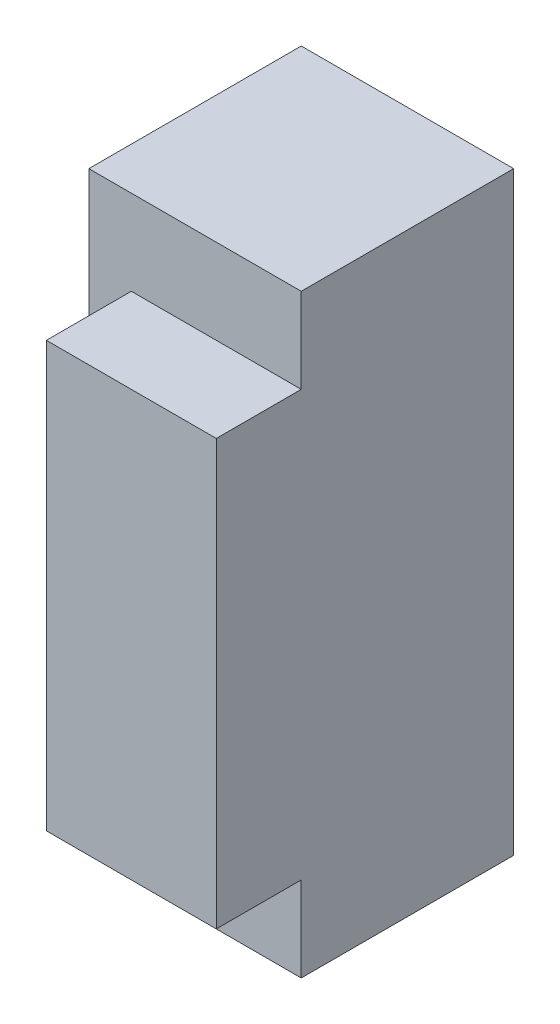
ISO-10303-21;
HEADER;
FILE_DESCRIPTION(('STEP AP214'),'2;1');
FILE_NAME('part.step','',(''),(''),'','','');
FILE_SCHEMA(('AUTOMOTIVE_DESIGN { 1 0 10303 214 1 1 1 1 }'));
ENDSEC;
DATA;
#1=APPLICATION_CONTEXT('core data for automotive mechanical design processes');
#2=APPLICATION_PROTOCOL_DEFINITION('international standard','automotive_design',2000,#1);
#3=PRODUCT_CONTEXT('',#1,'mechanical');
#4=PRODUCT('Part','Part','',(#3));
#5=PRODUCT_RELATED_PRODUCT_CATEGORY('part','',(#4));
#6=PRODUCT_DEFINITION_FORMATION('','',#4);
#7=PRODUCT_DEFINITION_CONTEXT('part definition',#1,'design');
#8=PRODUCT_DEFINITION('design','',#6,#7);
#9=PRODUCT_DEFINITION_SHAPE('','',#8);
#10=(LENGTH_UNIT() NAMED_UNIT(*) SI_UNIT(.MILLI.,.METRE.));
#11=(NAMED_UNIT(*) PLANE_ANGLE_UNIT() SI_UNIT($,.RADIAN.));
#12=(NAMED_UNIT(*) SI_UNIT($,.STERADIAN.) SOLID_ANGLE_UNIT());
#13=UNCERTAINTY_MEASURE_WITH_UNIT(LENGTH_MEASURE(1.E-05),#10,'distance_accuracy_value','');
#14=(GEOMETRIC_REPRESENTATION_CONTEXT(3) GLOBAL_UNCERTAINTY_ASSIGNED_CONTEXT((#13)) GLOBAL_UNIT_ASSIGNED_CONTEXT((#10,
#11,#12)) REPRESENTATION_CONTEXT('',''));
#15=CARTESIAN_POINT('',(0.,0.,0.));
#16=DIRECTION('',(0.,0.,1.));
#17=DIRECTION('',(1.,0.,0.));
#18=AXIS2_PLACEMENT_3D('',#15,#16,#17);
#19=CARTESIAN_POINT('',(-2.5,7.,5.));
#20=DIRECTION('',(1.,0.,0.));
#21=DIRECTION('',(0.,0.,-1.));
#22=AXIS2_PLACEMENT_3D('',#19,#20,#21);
#23=PLANE('',#22);
#24=DIRECTION('',(0.,-1.,0.));
#25=VECTOR('',#24,1.);
#26=CARTESIAN_POINT('',(-2.5,7.,0.));
#27=LINE('',#26,#25);
#28=CARTESIAN_POINT('',(-2.5,7.,0.));
#29=VERTEX_POINT('',#28);
#30=CARTESIAN_POINT('',(-2.5,-7.,0.));
#31=VERTEX_POINT('',#30);
#32=EDGE_CURVE('E118',#29,#31,#27,.T.);
#33=ORIENTED_EDGE('',*,*,#32,.T.);
#34=DIRECTION('',(0.,0.,-1.));
#35=VECTOR('',#34,1.);
#36=CARTESIAN_POINT('',(-2.5,-7.,5.));
#37=LINE('',#36,#35);
#38=CARTESIAN_POINT('',(-2.5,-7.,5.));
#39=VERTEX_POINT('',#38);
#40=EDGE_CURVE('E11',#39,#31,#37,.T.);
#41=ORIENTED_EDGE('',*,*,#40,.F.);
#42=DIRECTION('',(0.,-1.,0.));
#43=VECTOR('',#42,1.);
#44=CARTESIAN_POINT('',(-2.5,7.,5.));
#45=LINE('',#44,#43);
#46=CARTESIAN_POINT('',(-2.5,7.,5.));
#47=VERTEX_POINT('',#46);
#48=EDGE_CURVE('E140',#47,#39,#45,.T.);
#49=ORIENTED_EDGE('',*,*,#48,.F.);
#50=DIRECTION('',(0.,0.,-1.));
#51=VECTOR('',#50,1.);
#52=CARTESIAN_POINT('',(-2.5,7.,5.));
#53=LINE('',#52,#51);
#54=EDGE_CURVE('E159',#47,#29,#53,.T.);
#55=ORIENTED_EDGE('',*,*,#54,.T.);
#56=EDGE_LOOP('',(#33,#41,#49,#55));
#57=FACE_BOUND('',#56,.T.);
#58=ADVANCED_FACE('F30',(#57),#23,.F.);
#59=CARTESIAN_POINT('',(-2.5,-7.,5.));
#60=DIRECTION('',(0.,1.,0.));
#61=DIRECTION('',(0.,0.,1.));
#62=AXIS2_PLACEMENT_3D('',#59,#60,#61);
#63=PLANE('',#62);
#64=DIRECTION('',(1.,0.,0.));
#65=VECTOR('',#64,1.);
#66=CARTESIAN_POINT('',(-2.5,-7.,0.));
#67=LINE('',#66,#65);
#68=CARTESIAN_POINT('',(2.5,-7.,0.));
#69=VERTEX_POINT('',#68);
#70=EDGE_CURVE('E121',#31,#69,#67,.T.);
#71=ORIENTED_EDGE('',*,*,#70,.T.);
#72=DIRECTION('',(0.,0.,-1.));
#73=VECTOR('',#72,1.);
#74=CARTESIAN_POINT('',(2.5,-7.,5.));
#75=LINE('',#74,#73);
#76=CARTESIAN_POINT('',(2.5,-7.,5.));
#77=VERTEX_POINT('',#76);
#78=EDGE_CURVE('E38',#77,#69,#75,.T.);
#79=ORIENTED_EDGE('',*,*,#78,.F.);
#80=DIRECTION('',(1.,0.,0.));
#81=VECTOR('',#80,1.);
#82=CARTESIAN_POINT('',(-2.5,-7.,5.));
#83=LINE('',#82,#81);
#84=EDGE_CURVE('E143',#39,#77,#83,.T.);
#85=ORIENTED_EDGE('',*,*,#84,.F.);
#86=ORIENTED_EDGE('',*,*,#40,.T.);
#87=EDGE_LOOP('',(#71,#79,#85,#86));
#88=FACE_BOUND('',#87,.T.);
#89=ADVANCED_FACE('F167',(#88),#63,.F.);
#90=CARTESIAN_POINT('',(2.5,7.,5.));
#91=DIRECTION('',(-1.,0.,0.));
#92=DIRECTION('',(0.,-1.,0.));
#93=AXIS2_PLACEMENT_3D('',#90,#91,#92);
#94=PLANE('',#93);
#95=DIRECTION('',(0.,1.,0.));
#96=VECTOR('',#95,1.);
#97=CARTESIAN_POINT('',(2.5,7.,0.));
#98=LINE('',#97,#96);
#99=CARTESIAN_POINT('',(2.5,7.,0.));
#100=VERTEX_POINT('',#99);
#101=EDGE_CURVE('E163',#69,#100,#98,.T.);
#102=ORIENTED_EDGE('',*,*,#101,.T.);
#103=DIRECTION('',(0.,0.,-1.));
#104=VECTOR('',#103,1.);
#105=CARTESIAN_POINT('',(2.5,7.,5.));
#106=LINE('',#105,#104);
#107=CARTESIAN_POINT('',(2.5,7.,5.));
#108=VERTEX_POINT('',#107);
#109=EDGE_CURVE('E156',#108,#100,#106,.T.);
#110=ORIENTED_EDGE('',*,*,#109,.F.);
#111=DIRECTION('',(0.,1.,0.));
#112=VECTOR('',#111,1.);
#113=CARTESIAN_POINT('',(2.5,7.,5.));
#114=LINE('',#113,#112);
#115=CARTESIAN_POINT('',(2.5,5.,5.));
#116=VERTEX_POINT('',#115);
#117=EDGE_CURVE('E117',#116,#108,#114,.T.);
#118=ORIENTED_EDGE('',*,*,#117,.F.);
#119=DIRECTION('',(0.,0.,-1.));
#120=VECTOR('',#119,1.);
#121=CARTESIAN_POINT('',(2.5,5.,7.));
#122=LINE('',#121,#120);
#123=CARTESIAN_POINT('',(2.5,5.,7.));
#124=VERTEX_POINT('',#123);
#125=EDGE_CURVE('E99',#124,#116,#122,.T.);
#126=ORIENTED_EDGE('',*,*,#125,.F.);
#127=DIRECTION('',(0.,1.,0.));
#128=VECTOR('',#127,1.);
#129=CARTESIAN_POINT('',(2.5,-5.,7.));
#130=LINE('',#129,#128);
#131=CARTESIAN_POINT('',(2.5,-5.,7.));
#132=VERTEX_POINT('',#131);
#133=EDGE_CURVE('E105',#132,#124,#130,.T.);
#134=ORIENTED_EDGE('',*,*,#133,.F.);
#135=DIRECTION('',(0.,0.,-1.));
#136=VECTOR('',#135,1.);
#137=CARTESIAN_POINT('',(2.5,-5.,7.));
#138=LINE('',#137,#136);
#139=CARTESIAN_POINT('',(2.5,-5.,5.));
#140=VERTEX_POINT('',#139);
#141=EDGE_CURVE('E133',#132,#140,#138,.T.);
#142=ORIENTED_EDGE('',*,*,#141,.T.);
#143=EDGE_CURVE('E152',#77,#140,#114,.T.);
#144=ORIENTED_EDGE('',*,*,#143,.F.);
#145=ORIENTED_EDGE('',*,*,#78,.T.);
#146=EDGE_LOOP('',(#102,#110,#118,#126,#134,#142,#144,#145));
#147=FACE_BOUND('',#146,.T.);
#148=ADVANCED_FACE('F115',(#147),#94,.F.);
#149=CARTESIAN_POINT('',(-2.5,7.,5.));
#150=DIRECTION('',(0.,-1.,0.));
#151=DIRECTION('',(0.,0.,-1.));
#152=AXIS2_PLACEMENT_3D('',#149,#150,#151);
#153=PLANE('',#152);
#154=DIRECTION('',(-1.,0.,0.));
#155=VECTOR('',#154,1.);
#156=CARTESIAN_POINT('',(-2.5,7.,0.));
#157=LINE('',#156,#155);
#158=EDGE_CURVE('E144',#100,#29,#157,.T.);
#159=ORIENTED_EDGE('',*,*,#158,.T.);
#160=ORIENTED_EDGE('',*,*,#54,.F.);
#161=DIRECTION('',(-1.,0.,0.));
#162=VECTOR('',#161,1.);
#163=CARTESIAN_POINT('',(-2.5,7.,5.));
#164=LINE('',#163,#162);
#165=EDGE_CURVE('E148',#108,#47,#164,.T.);
#166=ORIENTED_EDGE('',*,*,#165,.F.);
#167=ORIENTED_EDGE('',*,*,#109,.T.);
#168=EDGE_LOOP('',(#159,#160,#166,#167));
#169=FACE_BOUND('',#168,.T.);
#170=ADVANCED_FACE('F177',(#169),#153,.F.);
#171=CARTESIAN_POINT('',(-2.5,-7.,5.));
#172=DIRECTION('',(0.,0.,1.));
#173=DIRECTION('',(1.,0.,0.));
#174=AXIS2_PLACEMENT_3D('',#171,#172,#173);
#175=PLANE('',#174);
#176=DIRECTION('',(1.,0.,0.));
#177=VECTOR('',#176,1.);
#178=CARTESIAN_POINT('',(2.5,-5.,5.));
#179=LINE('',#178,#177);
#180=CARTESIAN_POINT('',(-1.5,-5.,5.));
#181=VERTEX_POINT('',#180);
#182=EDGE_CURVE('E46',#181,#140,#179,.T.);
#183=ORIENTED_EDGE('',*,*,#182,.F.);
#184=DIRECTION('',(0.,-1.,0.));
#185=VECTOR('',#184,1.);
#186=CARTESIAN_POINT('',(-1.5,-5.,5.));
#187=LINE('',#186,#185);
#188=CARTESIAN_POINT('',(-1.5,5.,5.));
#189=VERTEX_POINT('',#188);
#190=EDGE_CURVE('E132',#189,#181,#187,.T.);
#191=ORIENTED_EDGE('',*,*,#190,.F.);
#192=DIRECTION('',(-1.,0.,0.));
#193=VECTOR('',#192,1.);
#194=CARTESIAN_POINT('',(2.5,5.,5.));
#195=LINE('',#194,#193);
#196=EDGE_CURVE('E52',#116,#189,#195,.T.);
#197=ORIENTED_EDGE('',*,*,#196,.F.);
#198=ORIENTED_EDGE('',*,*,#117,.T.);
#199=ORIENTED_EDGE('',*,*,#165,.T.);
#200=ORIENTED_EDGE('',*,*,#48,.T.);
#201=ORIENTED_EDGE('',*,*,#84,.T.);
#202=ORIENTED_EDGE('',*,*,#143,.T.);
#203=EDGE_LOOP('',(#183,#191,#197,#198,#199,#200,#201,#202));
#204=FACE_BOUND('',#203,.T.);
#205=ADVANCED_FACE('F181',(#204),#175,.T.);
#206=CARTESIAN_POINT('',(-2.5,-7.,0.));
#207=DIRECTION('',(0.,0.,1.));
#208=DIRECTION('',(1.,0.,0.));
#209=AXIS2_PLACEMENT_3D('',#206,#207,#208);
#210=PLANE('',#209);
#211=ORIENTED_EDGE('',*,*,#32,.F.);
#212=ORIENTED_EDGE('',*,*,#158,.F.);
#213=ORIENTED_EDGE('',*,*,#101,.F.);
#214=ORIENTED_EDGE('',*,*,#70,.F.);
#215=EDGE_LOOP('',(#211,#212,#213,#214));
#216=FACE_BOUND('',#215,.T.);
#217=ADVANCED_FACE('F174',(#216),#210,.F.);
#218=CARTESIAN_POINT('',(2.5,5.,7.));
#219=DIRECTION('',(0.,-1.,0.));
#220=DIRECTION('',(1.,0.,0.));
#221=AXIS2_PLACEMENT_3D('',#218,#219,#220);
#222=PLANE('',#221);
#223=ORIENTED_EDGE('',*,*,#196,.T.);
#224=DIRECTION('',(0.,0.,-1.));
#225=VECTOR('',#224,1.);
#226=CARTESIAN_POINT('',(-1.5,5.,7.));
#227=LINE('',#226,#225);
#228=CARTESIAN_POINT('',(-1.5,5.,7.));
#229=VERTEX_POINT('',#228);
#230=EDGE_CURVE('E101',#229,#189,#227,.T.);
#231=ORIENTED_EDGE('',*,*,#230,.F.);
#232=DIRECTION('',(-1.,0.,0.));
#233=VECTOR('',#232,1.);
#234=CARTESIAN_POINT('',(2.5,5.,7.));
#235=LINE('',#234,#233);
#236=EDGE_CURVE('E95',#124,#229,#235,.T.);
#237=ORIENTED_EDGE('',*,*,#236,.F.);
#238=ORIENTED_EDGE('',*,*,#125,.T.);
#239=EDGE_LOOP('',(#223,#231,#237,#238));
#240=FACE_BOUND('',#239,.T.);
#241=ADVANCED_FACE('F97',(#240),#222,.F.);
#242=CARTESIAN_POINT('',(-1.5,-5.,7.));
#243=DIRECTION('',(1.,0.,0.));
#244=DIRECTION('',(0.,1.,0.));
#245=AXIS2_PLACEMENT_3D('',#242,#243,#244);
#246=PLANE('',#245);
#247=ORIENTED_EDGE('',*,*,#190,.T.);
#248=DIRECTION('',(0.,0.,-1.));
#249=VECTOR('',#248,1.);
#250=CARTESIAN_POINT('',(-1.5,-5.,7.));
#251=LINE('',#250,#249);
#252=CARTESIAN_POINT('',(-1.5,-5.,7.));
#253=VERTEX_POINT('',#252);
#254=EDGE_CURVE('E123',#253,#181,#251,.T.);
#255=ORIENTED_EDGE('',*,*,#254,.F.);
#256=DIRECTION('',(0.,-1.,0.));
#257=VECTOR('',#256,1.);
#258=CARTESIAN_POINT('',(-1.5,-5.,7.));
#259=LINE('',#258,#257);
#260=EDGE_CURVE('E104',#229,#253,#259,.T.);
#261=ORIENTED_EDGE('',*,*,#260,.F.);
#262=ORIENTED_EDGE('',*,*,#230,.T.);
#263=EDGE_LOOP('',(#247,#255,#261,#262));
#264=FACE_BOUND('',#263,.T.);
#265=ADVANCED_FACE('F187',(#264),#246,.F.);
#266=CARTESIAN_POINT('',(2.5,-5.,7.));
#267=DIRECTION('',(0.,1.,0.));
#268=DIRECTION('',(-1.,0.,0.));
#269=AXIS2_PLACEMENT_3D('',#266,#267,#268);
#270=PLANE('',#269);
#271=ORIENTED_EDGE('',*,*,#182,.T.);
#272=ORIENTED_EDGE('',*,*,#141,.F.);
#273=DIRECTION('',(1.,0.,0.));
#274=VECTOR('',#273,1.);
#275=CARTESIAN_POINT('',(2.5,-5.,7.));
#276=LINE('',#275,#274);
#277=EDGE_CURVE('E110',#253,#132,#276,.T.);
#278=ORIENTED_EDGE('',*,*,#277,.F.);
#279=ORIENTED_EDGE('',*,*,#254,.T.);
#280=EDGE_LOOP('',(#271,#272,#278,#279));
#281=FACE_BOUND('',#280,.T.);
#282=ADVANCED_FACE('F183',(#281),#270,.F.);
#283=CARTESIAN_POINT('',(2.5,5.,7.));
#284=DIRECTION('',(0.,0.,1.));
#285=DIRECTION('',(1.,0.,0.));
#286=AXIS2_PLACEMENT_3D('',#283,#284,#285);
#287=PLANE('',#286);
#288=ORIENTED_EDGE('',*,*,#133,.T.);
#289=ORIENTED_EDGE('',*,*,#236,.T.);
#290=ORIENTED_EDGE('',*,*,#260,.T.);
#291=ORIENTED_EDGE('',*,*,#277,.T.);
#292=EDGE_LOOP('',(#288,#289,#290,#291));
#293=FACE_BOUND('',#292,.T.);
#294=ADVANCED_FACE('F108',(#293),#287,.T.);
#295=CLOSED_SHELL('',(#58,#89,#148,#170,#205,#217,#241,#265,#282,#294));
#296=MANIFOLD_SOLID_BREP('B2',#295);
#297=ADVANCED_BREP_SHAPE_REPRESENTATION('',(#18,#296),#14);
#298=SHAPE_DEFINITION_REPRESENTATION(#9,#297);
ENDSEC;
END-ISO-10303-21;
